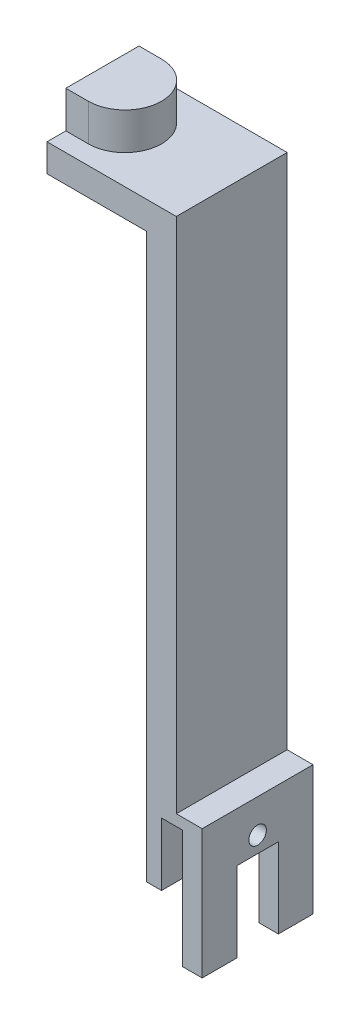
ISO-10303-21;
HEADER;
FILE_DESCRIPTION(('STEP AP214'),'2;1');
FILE_NAME('part.step','',(''),(''),'','','');
FILE_SCHEMA(('AUTOMOTIVE_DESIGN { 1 0 10303 214 1 1 1 1 }'));
ENDSEC;
DATA;
#1=APPLICATION_CONTEXT('core data for automotive mechanical design processes');
#2=APPLICATION_PROTOCOL_DEFINITION('international standard','automotive_design',2000,#1);
#3=PRODUCT_CONTEXT('',#1,'mechanical');
#4=PRODUCT('Part','Part','',(#3));
#5=PRODUCT_RELATED_PRODUCT_CATEGORY('part','',(#4));
#6=PRODUCT_DEFINITION_FORMATION('','',#4);
#7=PRODUCT_DEFINITION_CONTEXT('part definition',#1,'design');
#8=PRODUCT_DEFINITION('design','',#6,#7);
#9=PRODUCT_DEFINITION_SHAPE('','',#8);
#10=(LENGTH_UNIT() NAMED_UNIT(*) SI_UNIT(.MILLI.,.METRE.));
#11=(NAMED_UNIT(*) PLANE_ANGLE_UNIT() SI_UNIT($,.RADIAN.));
#12=(NAMED_UNIT(*) SI_UNIT($,.STERADIAN.) SOLID_ANGLE_UNIT());
#13=UNCERTAINTY_MEASURE_WITH_UNIT(LENGTH_MEASURE(1.E-05),#10,'distance_accuracy_value','');
#14=(GEOMETRIC_REPRESENTATION_CONTEXT(3) GLOBAL_UNCERTAINTY_ASSIGNED_CONTEXT((#13)) GLOBAL_UNIT_ASSIGNED_CONTEXT((#10,
#11,#12)) REPRESENTATION_CONTEXT('',''));
#15=CARTESIAN_POINT('',(0.,0.,0.));
#16=DIRECTION('',(0.,0.,1.));
#17=DIRECTION('',(1.,0.,0.));
#18=AXIS2_PLACEMENT_3D('',#15,#16,#17);
#19=CARTESIAN_POINT('',(2.2,-15.,15.));
#20=DIRECTION('',(0.,-1.,0.));
#21=DIRECTION('',(0.,0.,-1.));
#22=AXIS2_PLACEMENT_3D('',#19,#20,#21);
#23=PLANE('',#22);
#24=DIRECTION('',(1.,0.,0.));
#25=VECTOR('',#24,1.);
#26=CARTESIAN_POINT('',(-34.501,-15.,5.625));
#27=LINE('',#26,#25);
#28=CARTESIAN_POINT('',(2.2,-15.,5.625));
#29=VERTEX_POINT('',#28);
#30=CARTESIAN_POINT('',(7.5,-15.,5.625));
#31=VERTEX_POINT('',#30);
#32=EDGE_CURVE('E181',#29,#31,#27,.T.);
#33=ORIENTED_EDGE('',*,*,#32,.T.);
#34=DIRECTION('',(0.,0.,-1.));
#35=VECTOR('',#34,1.);
#36=CARTESIAN_POINT('',(7.5,-15.,15.));
#37=LINE('',#36,#35);
#38=CARTESIAN_POINT('',(7.5,-15.,15.));
#39=VERTEX_POINT('',#38);
#40=EDGE_CURVE('E210',#39,#31,#37,.T.);
#41=ORIENTED_EDGE('',*,*,#40,.F.);
#42=DIRECTION('',(1.,0.,0.));
#43=VECTOR('',#42,1.);
#44=CARTESIAN_POINT('',(2.2,-15.,15.));
#45=LINE('',#44,#43);
#46=CARTESIAN_POINT('',(2.2,-15.,15.));
#47=VERTEX_POINT('',#46);
#48=EDGE_CURVE('E205',#47,#39,#45,.T.);
#49=ORIENTED_EDGE('',*,*,#48,.F.);
#50=DIRECTION('',(0.,0.,-1.));
#51=VECTOR('',#50,1.);
#52=CARTESIAN_POINT('',(2.2,-15.,15.));
#53=LINE('',#52,#51);
#54=EDGE_CURVE('E199',#47,#29,#53,.T.);
#55=ORIENTED_EDGE('',*,*,#54,.T.);
#56=EDGE_LOOP('',(#33,#41,#49,#55));
#57=FACE_BOUND('',#56,.T.);
#58=ADVANCED_FACE('F43',(#57),#23,.T.);
#59=CARTESIAN_POINT('',(7.5,20.,15.));
#60=DIRECTION('',(0.,0.,-1.));
#61=DIRECTION('',(-1.,0.,0.));
#62=AXIS2_PLACEMENT_3D('',#59,#60,#61);
#63=PLANE('',#62);
#64=DIRECTION('',(1.,0.,0.));
#65=VECTOR('',#64,1.);
#66=CARTESIAN_POINT('',(0.,160.,15.));
#67=LINE('',#66,#65);
#68=CARTESIAN_POINT('',(-34.5,160.,15.));
#69=VERTEX_POINT('',#68);
#70=CARTESIAN_POINT('',(0.500000000000002,160.,15.));
#71=VERTEX_POINT('',#70);
#72=EDGE_CURVE('E226',#69,#71,#67,.T.);
#73=ORIENTED_EDGE('',*,*,#72,.F.);
#74=DIRECTION('',(0.,1.,0.));
#75=VECTOR('',#74,1.);
#76=CARTESIAN_POINT('',(-34.5,170.,15.));
#77=LINE('',#76,#75);
#78=CARTESIAN_POINT('',(-34.5,152.5,15.));
#79=VERTEX_POINT('',#78);
#80=EDGE_CURVE('E256',#79,#69,#77,.T.);
#81=ORIENTED_EDGE('',*,*,#80,.F.);
#82=DIRECTION('',(1.,0.,0.));
#83=VECTOR('',#82,1.);
#84=CARTESIAN_POINT('',(-34.5,152.5,15.));
#85=LINE('',#84,#83);
#86=CARTESIAN_POINT('',(-7.5,152.5,15.));
#87=VERTEX_POINT('',#86);
#88=EDGE_CURVE('E262',#79,#87,#85,.T.);
#89=ORIENTED_EDGE('',*,*,#88,.T.);
#90=DIRECTION('',(0.,-1.,0.));
#91=VECTOR('',#90,1.);
#92=CARTESIAN_POINT('',(-7.5,20.,15.));
#93=LINE('',#92,#91);
#94=CARTESIAN_POINT('',(-7.5,0.,15.));
#95=VERTEX_POINT('',#94);
#96=EDGE_CURVE('E11',#87,#95,#93,.T.);
#97=ORIENTED_EDGE('',*,*,#96,.T.);
#98=DIRECTION('',(1.,0.,0.));
#99=VECTOR('',#98,1.);
#100=CARTESIAN_POINT('',(7.5,0.,15.));
#101=LINE('',#100,#99);
#102=CARTESIAN_POINT('',(-3.5,0.,15.));
#103=VERTEX_POINT('',#102);
#104=EDGE_CURVE('E321',#95,#103,#101,.T.);
#105=ORIENTED_EDGE('',*,*,#104,.T.);
#106=DIRECTION('',(0.,-1.,0.));
#107=VECTOR('',#106,1.);
#108=CARTESIAN_POINT('',(-3.5,0.,15.));
#109=LINE('',#108,#107);
#110=CARTESIAN_POINT('',(-3.5,17.,15.));
#111=VERTEX_POINT('',#110);
#112=EDGE_CURVE('E286',#111,#103,#109,.T.);
#113=ORIENTED_EDGE('',*,*,#112,.F.);
#114=DIRECTION('',(-1.,0.,0.));
#115=VECTOR('',#114,1.);
#116=CARTESIAN_POINT('',(-3.5,17.,15.));
#117=LINE('',#116,#115);
#118=CARTESIAN_POINT('',(2.2,17.,15.));
#119=VERTEX_POINT('',#118);
#120=EDGE_CURVE('E291',#119,#111,#117,.T.);
#121=ORIENTED_EDGE('',*,*,#120,.F.);
#122=DIRECTION('',(0.,1.,0.));
#123=VECTOR('',#122,1.);
#124=CARTESIAN_POINT('',(2.2,0.,15.));
#125=LINE('',#124,#123);
#126=EDGE_CURVE('E299',#47,#119,#125,.T.);
#127=ORIENTED_EDGE('',*,*,#126,.F.);
#128=ORIENTED_EDGE('',*,*,#48,.T.);
#129=DIRECTION('',(0.,-1.,0.));
#130=VECTOR('',#129,1.);
#131=CARTESIAN_POINT('',(7.5,20.,15.));
#132=LINE('',#131,#130);
#133=CARTESIAN_POINT('',(7.5,20.,15.));
#134=VERTEX_POINT('',#133);
#135=EDGE_CURVE('E52',#134,#39,#132,.T.);
#136=ORIENTED_EDGE('',*,*,#135,.F.);
#137=DIRECTION('',(1.,0.,0.));
#138=VECTOR('',#137,1.);
#139=CARTESIAN_POINT('',(7.5,20.,15.));
#140=LINE('',#139,#138);
#141=CARTESIAN_POINT('',(0.5,20.,15.));
#142=VERTEX_POINT('',#141);
#143=EDGE_CURVE('E310',#142,#134,#140,.T.);
#144=ORIENTED_EDGE('',*,*,#143,.F.);
#145=DIRECTION('',(0.,-1.,0.));
#146=VECTOR('',#145,1.);
#147=CARTESIAN_POINT('',(0.500000000000002,170.,15.));
#148=LINE('',#147,#146);
#149=EDGE_CURVE('E284',#71,#142,#148,.T.);
#150=ORIENTED_EDGE('',*,*,#149,.F.);
#151=EDGE_LOOP('',(#73,#81,#89,#97,#105,#113,#121,#127,#128,#136,#144,#150));
#152=FACE_BOUND('',#151,.T.);
#153=ADVANCED_FACE('F338',(#152),#63,.F.);
#154=CARTESIAN_POINT('',(7.5,20.,-15.));
#155=DIRECTION('',(0.,0.,1.));
#156=DIRECTION('',(1.,0.,0.));
#157=AXIS2_PLACEMENT_3D('',#154,#155,#156);
#158=PLANE('',#157);
#159=DIRECTION('',(-1.,0.,0.));
#160=VECTOR('',#159,1.);
#161=CARTESIAN_POINT('',(0.,160.,-15.));
#162=LINE('',#161,#160);
#163=CARTESIAN_POINT('',(0.499999999999999,160.,-15.));
#164=VERTEX_POINT('',#163);
#165=CARTESIAN_POINT('',(-34.5,160.,-15.));
#166=VERTEX_POINT('',#165);
#167=EDGE_CURVE('E67',#164,#166,#162,.T.);
#168=ORIENTED_EDGE('',*,*,#167,.F.);
#169=DIRECTION('',(0.,-1.,0.));
#170=VECTOR('',#169,1.);
#171=CARTESIAN_POINT('',(0.499999999999999,170.,-15.));
#172=LINE('',#171,#170);
#173=CARTESIAN_POINT('',(0.499999999999999,20.,-15.));
#174=VERTEX_POINT('',#173);
#175=EDGE_CURVE('E282',#164,#174,#172,.T.);
#176=ORIENTED_EDGE('',*,*,#175,.T.);
#177=DIRECTION('',(-1.,0.,0.));
#178=VECTOR('',#177,1.);
#179=CARTESIAN_POINT('',(7.5,20.,-15.));
#180=LINE('',#179,#178);
#181=CARTESIAN_POINT('',(7.5,20.,-15.));
#182=VERTEX_POINT('',#181);
#183=EDGE_CURVE('E315',#182,#174,#180,.T.);
#184=ORIENTED_EDGE('',*,*,#183,.F.);
#185=DIRECTION('',(0.,-1.,0.));
#186=VECTOR('',#185,1.);
#187=CARTESIAN_POINT('',(7.5,20.,-15.));
#188=LINE('',#187,#186);
#189=CARTESIAN_POINT('',(7.5,-15.,-15.));
#190=VERTEX_POINT('',#189);
#191=EDGE_CURVE('E327',#182,#190,#188,.T.);
#192=ORIENTED_EDGE('',*,*,#191,.T.);
#193=DIRECTION('',(1.,0.,0.));
#194=VECTOR('',#193,1.);
#195=CARTESIAN_POINT('',(2.2,-15.,-15.));
#196=LINE('',#195,#194);
#197=CARTESIAN_POINT('',(2.2,-15.,-15.));
#198=VERTEX_POINT('',#197);
#199=EDGE_CURVE('E208',#198,#190,#196,.T.);
#200=ORIENTED_EDGE('',*,*,#199,.F.);
#201=DIRECTION('',(0.,1.,0.));
#202=VECTOR('',#201,1.);
#203=CARTESIAN_POINT('',(2.2,0.,-15.));
#204=LINE('',#203,#202);
#205=CARTESIAN_POINT('',(2.2,17.,-15.));
#206=VERTEX_POINT('',#205);
#207=EDGE_CURVE('E290',#198,#206,#204,.T.);
#208=ORIENTED_EDGE('',*,*,#207,.T.);
#209=DIRECTION('',(-1.,0.,0.));
#210=VECTOR('',#209,1.);
#211=CARTESIAN_POINT('',(-3.5,17.,-15.));
#212=LINE('',#211,#210);
#213=CARTESIAN_POINT('',(-3.5,17.,-15.));
#214=VERTEX_POINT('',#213);
#215=EDGE_CURVE('E294',#206,#214,#212,.T.);
#216=ORIENTED_EDGE('',*,*,#215,.T.);
#217=DIRECTION('',(0.,-1.,0.));
#218=VECTOR('',#217,1.);
#219=CARTESIAN_POINT('',(-3.5,0.,-15.));
#220=LINE('',#219,#218);
#221=CARTESIAN_POINT('',(-3.5,0.,-15.));
#222=VERTEX_POINT('',#221);
#223=EDGE_CURVE('E287',#214,#222,#220,.T.);
#224=ORIENTED_EDGE('',*,*,#223,.T.);
#225=DIRECTION('',(-1.,0.,0.));
#226=VECTOR('',#225,1.);
#227=CARTESIAN_POINT('',(7.5,0.,-15.));
#228=LINE('',#227,#226);
#229=CARTESIAN_POINT('',(-7.5,0.,-15.));
#230=VERTEX_POINT('',#229);
#231=EDGE_CURVE('E313',#222,#230,#228,.T.);
#232=ORIENTED_EDGE('',*,*,#231,.T.);
#233=DIRECTION('',(0.,-1.,0.));
#234=VECTOR('',#233,1.);
#235=CARTESIAN_POINT('',(-7.5,20.,-15.));
#236=LINE('',#235,#234);
#237=CARTESIAN_POINT('',(-7.5,152.5,-15.));
#238=VERTEX_POINT('',#237);
#239=EDGE_CURVE('E318',#238,#230,#236,.T.);
#240=ORIENTED_EDGE('',*,*,#239,.F.);
#241=DIRECTION('',(1.,0.,0.));
#242=VECTOR('',#241,1.);
#243=CARTESIAN_POINT('',(-34.5,152.5,-15.));
#244=LINE('',#243,#242);
#245=CARTESIAN_POINT('',(-34.5,152.5,-15.));
#246=VERTEX_POINT('',#245);
#247=EDGE_CURVE('E267',#246,#238,#244,.T.);
#248=ORIENTED_EDGE('',*,*,#247,.F.);
#249=DIRECTION('',(0.,-1.,0.));
#250=VECTOR('',#249,1.);
#251=CARTESIAN_POINT('',(-34.5,170.,-15.));
#252=LINE('',#251,#250);
#253=EDGE_CURVE('E252',#166,#246,#252,.T.);
#254=ORIENTED_EDGE('',*,*,#253,.F.);
#255=EDGE_LOOP('',(#168,#176,#184,#192,#200,#208,#216,#224,#232,#240,#248,#254));
#256=FACE_BOUND('',#255,.T.);
#257=ADVANCED_FACE('F349',(#256),#158,.F.);
#258=CARTESIAN_POINT('',(0.499999999999999,170.,-15.));
#259=DIRECTION('',(-1.,0.,0.));
#260=DIRECTION('',(0.,0.,1.));
#261=AXIS2_PLACEMENT_3D('',#258,#259,#260);
#262=PLANE('',#261);
#263=DIRECTION('',(0.,0.,-1.));
#264=VECTOR('',#263,1.);
#265=CARTESIAN_POINT('',(0.5,160.,0.));
#266=LINE('',#265,#264);
#267=EDGE_CURVE('E229',#71,#164,#266,.T.);
#268=ORIENTED_EDGE('',*,*,#267,.F.);
#269=ORIENTED_EDGE('',*,*,#149,.T.);
#270=DIRECTION('',(0.,0.,-1.));
#271=VECTOR('',#270,1.);
#272=CARTESIAN_POINT('',(0.499999999999999,20.,-15.));
#273=LINE('',#272,#271);
#274=EDGE_CURVE('E279',#142,#174,#273,.T.);
#275=ORIENTED_EDGE('',*,*,#274,.T.);
#276=ORIENTED_EDGE('',*,*,#175,.F.);
#277=EDGE_LOOP('',(#268,#269,#275,#276));
#278=FACE_BOUND('',#277,.T.);
#279=ADVANCED_FACE('F425',(#278),#262,.F.);
#280=CARTESIAN_POINT('',(0.,170.,0.));
#281=DIRECTION('',(0.,1.,0.));
#282=DIRECTION('',(0.,0.,1.));
#283=AXIS2_PLACEMENT_3D('',#280,#281,#282);
#284=PLANE('',#283);
#285=CARTESIAN_POINT('',(-28.4,170.,0.));
#286=DIRECTION('',(0.,1.,0.));
#287=DIRECTION('',(0.,0.,1.));
#288=AXIS2_PLACEMENT_3D('',#285,#286,#287);
#289=CIRCLE('',#288,9.9);
#290=CARTESIAN_POINT('',(-28.4,170.,9.9));
#291=VERTEX_POINT('',#290);
#292=CARTESIAN_POINT('',(-28.4,170.,-9.9));
#293=VERTEX_POINT('',#292);
#294=EDGE_CURVE('E216',#291,#293,#289,.T.);
#295=ORIENTED_EDGE('',*,*,#294,.T.);
#296=DIRECTION('',(-1.,0.,0.));
#297=VECTOR('',#296,1.);
#298=CARTESIAN_POINT('',(0.,170.,-9.9));
#299=LINE('',#298,#297);
#300=CARTESIAN_POINT('',(-34.5,170.,-9.9));
#301=VERTEX_POINT('',#300);
#302=EDGE_CURVE('E222',#293,#301,#299,.T.);
#303=ORIENTED_EDGE('',*,*,#302,.T.);
#304=DIRECTION('',(0.,0.,-1.));
#305=VECTOR('',#304,1.);
#306=CARTESIAN_POINT('',(-34.5,170.,-15.));
#307=LINE('',#306,#305);
#308=CARTESIAN_POINT('',(-34.5,170.,9.9));
#309=VERTEX_POINT('',#308);
#310=EDGE_CURVE('E259',#309,#301,#307,.T.);
#311=ORIENTED_EDGE('',*,*,#310,.F.);
#312=DIRECTION('',(1.,0.,0.));
#313=VECTOR('',#312,1.);
#314=CARTESIAN_POINT('',(0.,170.,9.90000000000001));
#315=LINE('',#314,#313);
#316=EDGE_CURVE('E237',#309,#291,#315,.T.);
#317=ORIENTED_EDGE('',*,*,#316,.T.);
#318=EDGE_LOOP('',(#295,#303,#311,#317));
#319=FACE_BOUND('',#318,.T.);
#320=ADVANCED_FACE('F413',(#319),#284,.T.);
#321=CARTESIAN_POINT('',(-34.5,0.,0.));
#322=DIRECTION('',(-1.,0.,0.));
#323=DIRECTION('',(0.,0.,1.));
#324=AXIS2_PLACEMENT_3D('',#321,#322,#323);
#325=PLANE('',#324);
#326=DIRECTION('',(0.,0.,1.));
#327=VECTOR('',#326,1.);
#328=CARTESIAN_POINT('',(-34.5,160.,0.));
#329=LINE('',#328,#327);
#330=CARTESIAN_POINT('',(-34.5,160.,9.9));
#331=VERTEX_POINT('',#330);
#332=EDGE_CURVE('E224',#331,#69,#329,.T.);
#333=ORIENTED_EDGE('',*,*,#332,.F.);
#334=DIRECTION('',(0.,1.,0.));
#335=VECTOR('',#334,1.);
#336=CARTESIAN_POINT('',(-34.5,160.,9.9));
#337=LINE('',#336,#335);
#338=EDGE_CURVE('E248',#331,#309,#337,.T.);
#339=ORIENTED_EDGE('',*,*,#338,.T.);
#340=ORIENTED_EDGE('',*,*,#310,.T.);
#341=DIRECTION('',(0.,1.,0.));
#342=VECTOR('',#341,1.);
#343=CARTESIAN_POINT('',(-34.5,160.,-9.9));
#344=LINE('',#343,#342);
#345=CARTESIAN_POINT('',(-34.5,160.,-9.9));
#346=VERTEX_POINT('',#345);
#347=EDGE_CURVE('E246',#346,#301,#344,.T.);
#348=ORIENTED_EDGE('',*,*,#347,.F.);
#349=EDGE_CURVE('E227',#166,#346,#329,.T.);
#350=ORIENTED_EDGE('',*,*,#349,.F.);
#351=ORIENTED_EDGE('',*,*,#253,.T.);
#352=DIRECTION('',(0.,0.,1.));
#353=VECTOR('',#352,1.);
#354=CARTESIAN_POINT('',(-34.5,152.5,-15.));
#355=LINE('',#354,#353);
#356=EDGE_CURVE('E254',#246,#79,#355,.T.);
#357=ORIENTED_EDGE('',*,*,#356,.T.);
#358=ORIENTED_EDGE('',*,*,#80,.T.);
#359=EDGE_LOOP('',(#333,#339,#340,#348,#350,#351,#357,#358));
#360=FACE_BOUND('',#359,.T.);
#361=ADVANCED_FACE('F410',(#360),#325,.T.);
#362=CARTESIAN_POINT('',(-7.5,20.,15.));
#363=DIRECTION('',(1.,0.,0.));
#364=DIRECTION('',(0.,0.,-1.));
#365=AXIS2_PLACEMENT_3D('',#362,#363,#364);
#366=PLANE('',#365);
#367=CARTESIAN_POINT('',(-7.5,11.,0.));
#368=DIRECTION('',(1.,0.,0.));
#369=DIRECTION('',(0.,0.,-1.));
#370=AXIS2_PLACEMENT_3D('',#367,#368,#369);
#371=CIRCLE('',#370,2.375);
#372=CARTESIAN_POINT('',(-7.5,11.,-2.375));
#373=VERTEX_POINT('',#372);
#374=EDGE_CURVE('E271',#373,#373,#371,.T.);
#375=ORIENTED_EDGE('',*,*,#374,.T.);
#376=EDGE_LOOP('',(#375));
#377=FACE_BOUND('',#376,.T.);
#378=DIRECTION('',(0.,0.,1.));
#379=VECTOR('',#378,1.);
#380=CARTESIAN_POINT('',(-7.5,152.5,-15.));
#381=LINE('',#380,#379);
#382=EDGE_CURVE('E245',#238,#87,#381,.T.);
#383=ORIENTED_EDGE('',*,*,#382,.F.);
#384=ORIENTED_EDGE('',*,*,#239,.T.);
#385=DIRECTION('',(0.,0.,1.));
#386=VECTOR('',#385,1.);
#387=CARTESIAN_POINT('',(-7.5,0.,15.));
#388=LINE('',#387,#386);
#389=EDGE_CURVE('E305',#230,#95,#388,.T.);
#390=ORIENTED_EDGE('',*,*,#389,.T.);
#391=ORIENTED_EDGE('',*,*,#96,.F.);
#392=EDGE_LOOP('',(#383,#384,#390,#391));
#393=FACE_BOUND('',#392,.T.);
#394=ADVANCED_FACE('F45',(#377,#393),#366,.F.);
#395=CARTESIAN_POINT('',(0.,0.,0.));
#396=DIRECTION('',(0.,1.,0.));
#397=DIRECTION('',(0.,0.,1.));
#398=AXIS2_PLACEMENT_3D('',#395,#396,#397);
#399=PLANE('',#398);
#400=ORIENTED_EDGE('',*,*,#231,.F.);
#401=DIRECTION('',(0.,0.,1.));
#402=VECTOR('',#401,1.);
#403=CARTESIAN_POINT('',(-3.5,0.,-15.));
#404=LINE('',#403,#402);
#405=EDGE_CURVE('E297',#222,#103,#404,.T.);
#406=ORIENTED_EDGE('',*,*,#405,.T.);
#407=ORIENTED_EDGE('',*,*,#104,.F.);
#408=ORIENTED_EDGE('',*,*,#389,.F.);
#409=EDGE_LOOP('',(#400,#406,#407,#408));
#410=FACE_BOUND('',#409,.T.);
#411=ADVANCED_FACE('F442',(#410),#399,.F.);
#412=CARTESIAN_POINT('',(7.5,20.,15.));
#413=DIRECTION('',(-1.,0.,0.));
#414=DIRECTION('',(0.,0.,1.));
#415=AXIS2_PLACEMENT_3D('',#412,#413,#414);
#416=PLANE('',#415);
#417=CARTESIAN_POINT('',(7.5,11.,0.));
#418=DIRECTION('',(1.,0.,0.));
#419=DIRECTION('',(0.,0.,-1.));
#420=AXIS2_PLACEMENT_3D('',#417,#418,#419);
#421=CIRCLE('',#420,2.375);
#422=CARTESIAN_POINT('',(7.5,11.,-2.375));
#423=VERTEX_POINT('',#422);
#424=EDGE_CURVE('E270',#423,#423,#421,.T.);
#425=ORIENTED_EDGE('',*,*,#424,.F.);
#426=EDGE_LOOP('',(#425));
#427=FACE_BOUND('',#426,.T.);
#428=ORIENTED_EDGE('',*,*,#40,.T.);
#429=DIRECTION('',(0.,-1.,0.));
#430=VECTOR('',#429,1.);
#431=CARTESIAN_POINT('',(7.5,-15.,5.625));
#432=LINE('',#431,#430);
#433=CARTESIAN_POINT('',(7.5,6.625,5.625));
#434=VERTEX_POINT('',#433);
#435=EDGE_CURVE('E187',#434,#31,#432,.T.);
#436=ORIENTED_EDGE('',*,*,#435,.F.);
#437=DIRECTION('',(0.,0.,1.));
#438=VECTOR('',#437,1.);
#439=CARTESIAN_POINT('',(7.5,6.625,5.625));
#440=LINE('',#439,#438);
#441=CARTESIAN_POINT('',(7.5,6.625,-5.625));
#442=VERTEX_POINT('',#441);
#443=EDGE_CURVE('E193',#442,#434,#440,.T.);
#444=ORIENTED_EDGE('',*,*,#443,.F.);
#445=DIRECTION('',(0.,1.,0.));
#446=VECTOR('',#445,1.);
#447=CARTESIAN_POINT('',(7.5,-15.,-5.625));
#448=LINE('',#447,#446);
#449=CARTESIAN_POINT('',(7.5,-15.,-5.625));
#450=VERTEX_POINT('',#449);
#451=EDGE_CURVE('E358',#450,#442,#448,.T.);
#452=ORIENTED_EDGE('',*,*,#451,.F.);
#453=EDGE_CURVE('E214',#450,#190,#37,.T.);
#454=ORIENTED_EDGE('',*,*,#453,.T.);
#455=ORIENTED_EDGE('',*,*,#191,.F.);
#456=DIRECTION('',(0.,0.,-1.));
#457=VECTOR('',#456,1.);
#458=CARTESIAN_POINT('',(7.5,20.,15.));
#459=LINE('',#458,#457);
#460=EDGE_CURVE('E312',#134,#182,#459,.T.);
#461=ORIENTED_EDGE('',*,*,#460,.F.);
#462=ORIENTED_EDGE('',*,*,#135,.T.);
#463=EDGE_LOOP('',(#428,#436,#444,#452,#454,#455,#461,#462));
#464=FACE_BOUND('',#463,.T.);
#465=ADVANCED_FACE('F333',(#427,#464),#416,.F.);
#466=CARTESIAN_POINT('',(0.,20.,0.));
#467=DIRECTION('',(0.,1.,0.));
#468=DIRECTION('',(0.,0.,1.));
#469=AXIS2_PLACEMENT_3D('',#466,#467,#468);
#470=PLANE('',#469);
#471=ORIENTED_EDGE('',*,*,#274,.F.);
#472=ORIENTED_EDGE('',*,*,#143,.T.);
#473=ORIENTED_EDGE('',*,*,#460,.T.);
#474=ORIENTED_EDGE('',*,*,#183,.T.);
#475=EDGE_LOOP('',(#471,#472,#473,#474));
#476=FACE_BOUND('',#475,.T.);
#477=ADVANCED_FACE('F437',(#476),#470,.T.);
#478=CARTESIAN_POINT('',(-3.5,0.,-15.));
#479=DIRECTION('',(-1.,0.,0.));
#480=DIRECTION('',(0.,0.,1.));
#481=AXIS2_PLACEMENT_3D('',#478,#479,#480);
#482=PLANE('',#481);
#483=CARTESIAN_POINT('',(-3.5,11.,0.));
#484=DIRECTION('',(-1.,0.,0.));
#485=DIRECTION('',(0.,0.,1.));
#486=AXIS2_PLACEMENT_3D('',#483,#484,#485);
#487=CIRCLE('',#486,2.375);
#488=CARTESIAN_POINT('',(-3.5,11.,2.375));
#489=VERTEX_POINT('',#488);
#490=EDGE_CURVE('E276',#489,#489,#487,.T.);
#491=ORIENTED_EDGE('',*,*,#490,.T.);
#492=EDGE_LOOP('',(#491));
#493=FACE_BOUND('',#492,.T.);
#494=ORIENTED_EDGE('',*,*,#112,.T.);
#495=ORIENTED_EDGE('',*,*,#405,.F.);
#496=ORIENTED_EDGE('',*,*,#223,.F.);
#497=DIRECTION('',(0.,0.,1.));
#498=VECTOR('',#497,1.);
#499=CARTESIAN_POINT('',(-3.5,17.,-15.));
#500=LINE('',#499,#498);
#501=EDGE_CURVE('E303',#214,#111,#500,.T.);
#502=ORIENTED_EDGE('',*,*,#501,.T.);
#503=EDGE_LOOP('',(#494,#495,#496,#502));
#504=FACE_BOUND('',#503,.T.);
#505=ADVANCED_FACE('F432',(#493,#504),#482,.F.);
#506=CARTESIAN_POINT('',(-3.5,17.,-15.));
#507=DIRECTION('',(0.,1.,0.));
#508=DIRECTION('',(0.,0.,1.));
#509=AXIS2_PLACEMENT_3D('',#506,#507,#508);
#510=PLANE('',#509);
#511=ORIENTED_EDGE('',*,*,#120,.T.);
#512=ORIENTED_EDGE('',*,*,#501,.F.);
#513=ORIENTED_EDGE('',*,*,#215,.F.);
#514=DIRECTION('',(0.,0.,1.));
#515=VECTOR('',#514,1.);
#516=CARTESIAN_POINT('',(2.2,17.,-15.));
#517=LINE('',#516,#515);
#518=EDGE_CURVE('E306',#206,#119,#517,.T.);
#519=ORIENTED_EDGE('',*,*,#518,.T.);
#520=EDGE_LOOP('',(#511,#512,#513,#519));
#521=FACE_BOUND('',#520,.T.);
#522=ADVANCED_FACE('F346',(#521),#510,.F.);
#523=CARTESIAN_POINT('',(2.2,0.,-15.));
#524=DIRECTION('',(1.,0.,0.));
#525=DIRECTION('',(0.,0.,-1.));
#526=AXIS2_PLACEMENT_3D('',#523,#524,#525);
#527=PLANE('',#526);
#528=CARTESIAN_POINT('',(2.2,11.,0.));
#529=DIRECTION('',(1.,0.,0.));
#530=DIRECTION('',(0.,0.,-1.));
#531=AXIS2_PLACEMENT_3D('',#528,#529,#530);
#532=CIRCLE('',#531,2.375);
#533=CARTESIAN_POINT('',(2.2,11.,-2.375));
#534=VERTEX_POINT('',#533);
#535=EDGE_CURVE('E47',#534,#534,#532,.T.);
#536=ORIENTED_EDGE('',*,*,#535,.T.);
#537=EDGE_LOOP('',(#536));
#538=FACE_BOUND('',#537,.T.);
#539=DIRECTION('',(0.,0.,-1.));
#540=VECTOR('',#539,1.);
#541=CARTESIAN_POINT('',(2.2,6.625,5.625));
#542=LINE('',#541,#540);
#543=CARTESIAN_POINT('',(2.2,6.625,5.625));
#544=VERTEX_POINT('',#543);
#545=CARTESIAN_POINT('',(2.2,6.625,-5.625));
#546=VERTEX_POINT('',#545);
#547=EDGE_CURVE('E201',#544,#546,#542,.T.);
#548=ORIENTED_EDGE('',*,*,#547,.F.);
#549=DIRECTION('',(0.,1.,0.));
#550=VECTOR('',#549,1.);
#551=CARTESIAN_POINT('',(2.2,-15.,5.625));
#552=LINE('',#551,#550);
#553=EDGE_CURVE('E184',#29,#544,#552,.T.);
#554=ORIENTED_EDGE('',*,*,#553,.F.);
#555=ORIENTED_EDGE('',*,*,#54,.F.);
#556=ORIENTED_EDGE('',*,*,#126,.T.);
#557=ORIENTED_EDGE('',*,*,#518,.F.);
#558=ORIENTED_EDGE('',*,*,#207,.F.);
#559=CARTESIAN_POINT('',(2.2,-15.,-5.625));
#560=VERTEX_POINT('',#559);
#561=EDGE_CURVE('E206',#560,#198,#53,.T.);
#562=ORIENTED_EDGE('',*,*,#561,.F.);
#563=DIRECTION('',(0.,-1.,0.));
#564=VECTOR('',#563,1.);
#565=CARTESIAN_POINT('',(2.2,-15.,-5.625));
#566=LINE('',#565,#564);
#567=EDGE_CURVE('E59',#546,#560,#566,.T.);
#568=ORIENTED_EDGE('',*,*,#567,.F.);
#569=EDGE_LOOP('',(#548,#554,#555,#556,#557,#558,#562,#568));
#570=FACE_BOUND('',#569,.T.);
#571=ADVANCED_FACE('F197',(#538,#570),#527,.F.);
#572=CARTESIAN_POINT('',(-7.5,11.,0.));
#573=DIRECTION('',(1.,0.,0.));
#574=DIRECTION('',(0.,0.,-1.));
#575=AXIS2_PLACEMENT_3D('',#572,#573,#574);
#576=CYLINDRICAL_SURFACE('',#575,2.375);
#577=ORIENTED_EDGE('',*,*,#424,.T.);
#578=EDGE_LOOP('',(#577));
#579=FACE_BOUND('',#578,.T.);
#580=ORIENTED_EDGE('',*,*,#535,.F.);
#581=EDGE_LOOP('',(#580));
#582=FACE_BOUND('',#581,.T.);
#583=ADVANCED_FACE('F421',(#579,#582),#576,.F.);
#584=ORIENTED_EDGE('',*,*,#374,.F.);
#585=EDGE_LOOP('',(#584));
#586=FACE_BOUND('',#585,.T.);
#587=ORIENTED_EDGE('',*,*,#490,.F.);
#588=EDGE_LOOP('',(#587));
#589=FACE_BOUND('',#588,.T.);
#590=ADVANCED_FACE('F417',(#586,#589),#576,.F.);
#591=CARTESIAN_POINT('',(-34.5,152.5,-15.));
#592=DIRECTION('',(0.,1.,0.));
#593=DIRECTION('',(0.,0.,1.));
#594=AXIS2_PLACEMENT_3D('',#591,#592,#593);
#595=PLANE('',#594);
#596=ORIENTED_EDGE('',*,*,#382,.T.);
#597=ORIENTED_EDGE('',*,*,#88,.F.);
#598=ORIENTED_EDGE('',*,*,#356,.F.);
#599=ORIENTED_EDGE('',*,*,#247,.T.);
#600=EDGE_LOOP('',(#596,#597,#598,#599));
#601=FACE_BOUND('',#600,.T.);
#602=ADVANCED_FACE('F408',(#601),#595,.F.);
#603=CARTESIAN_POINT('',(-28.4,160.,0.));
#604=DIRECTION('',(0.,1.,0.));
#605=DIRECTION('',(0.,0.,1.));
#606=AXIS2_PLACEMENT_3D('',#603,#604,#605);
#607=CYLINDRICAL_SURFACE('',#606,9.9);
#608=ORIENTED_EDGE('',*,*,#294,.F.);
#609=DIRECTION('',(0.,1.,0.));
#610=VECTOR('',#609,1.);
#611=CARTESIAN_POINT('',(-28.4,160.,9.9));
#612=LINE('',#611,#610);
#613=CARTESIAN_POINT('',(-28.4,160.,9.9));
#614=VERTEX_POINT('',#613);
#615=EDGE_CURVE('E234',#614,#291,#612,.T.);
#616=ORIENTED_EDGE('',*,*,#615,.F.);
#617=CARTESIAN_POINT('',(-28.4,160.,0.));
#618=DIRECTION('',(0.,1.,0.));
#619=DIRECTION('',(0.,0.,1.));
#620=AXIS2_PLACEMENT_3D('',#617,#618,#619);
#621=CIRCLE('',#620,9.9);
#622=CARTESIAN_POINT('',(-28.4,160.,-9.9));
#623=VERTEX_POINT('',#622);
#624=EDGE_CURVE('E218',#614,#623,#621,.T.);
#625=ORIENTED_EDGE('',*,*,#624,.T.);
#626=DIRECTION('',(0.,1.,0.));
#627=VECTOR('',#626,1.);
#628=CARTESIAN_POINT('',(-28.4,160.,-9.9));
#629=LINE('',#628,#627);
#630=EDGE_CURVE('E242',#623,#293,#629,.T.);
#631=ORIENTED_EDGE('',*,*,#630,.T.);
#632=EDGE_LOOP('',(#608,#616,#625,#631));
#633=FACE_BOUND('',#632,.T.);
#634=ADVANCED_FACE('F403',(#633),#607,.T.);
#635=CARTESIAN_POINT('',(0.,160.,-9.9));
#636=DIRECTION('',(0.,0.,-1.));
#637=DIRECTION('',(-1.,0.,0.));
#638=AXIS2_PLACEMENT_3D('',#635,#636,#637);
#639=PLANE('',#638);
#640=ORIENTED_EDGE('',*,*,#302,.F.);
#641=ORIENTED_EDGE('',*,*,#630,.F.);
#642=DIRECTION('',(-1.,0.,0.));
#643=VECTOR('',#642,1.);
#644=CARTESIAN_POINT('',(0.,160.,-9.9));
#645=LINE('',#644,#643);
#646=EDGE_CURVE('E232',#623,#346,#645,.T.);
#647=ORIENTED_EDGE('',*,*,#646,.T.);
#648=ORIENTED_EDGE('',*,*,#347,.T.);
#649=EDGE_LOOP('',(#640,#641,#647,#648));
#650=FACE_BOUND('',#649,.T.);
#651=ADVANCED_FACE('F397',(#650),#639,.T.);
#652=CARTESIAN_POINT('',(0.,160.,9.90000000000001));
#653=DIRECTION('',(0.,0.,1.));
#654=DIRECTION('',(1.,0.,0.));
#655=AXIS2_PLACEMENT_3D('',#652,#653,#654);
#656=PLANE('',#655);
#657=ORIENTED_EDGE('',*,*,#316,.F.);
#658=ORIENTED_EDGE('',*,*,#338,.F.);
#659=DIRECTION('',(1.,0.,0.));
#660=VECTOR('',#659,1.);
#661=CARTESIAN_POINT('',(0.,160.,9.90000000000001));
#662=LINE('',#661,#660);
#663=EDGE_CURVE('E221',#331,#614,#662,.T.);
#664=ORIENTED_EDGE('',*,*,#663,.T.);
#665=ORIENTED_EDGE('',*,*,#615,.T.);
#666=EDGE_LOOP('',(#657,#658,#664,#665));
#667=FACE_BOUND('',#666,.T.);
#668=ADVANCED_FACE('F393',(#667),#656,.T.);
#669=CARTESIAN_POINT('',(0.,160.,0.));
#670=DIRECTION('',(0.,1.,0.));
#671=DIRECTION('',(0.,0.,1.));
#672=AXIS2_PLACEMENT_3D('',#669,#670,#671);
#673=PLANE('',#672);
#674=ORIENTED_EDGE('',*,*,#624,.F.);
#675=ORIENTED_EDGE('',*,*,#663,.F.);
#676=ORIENTED_EDGE('',*,*,#332,.T.);
#677=ORIENTED_EDGE('',*,*,#72,.T.);
#678=ORIENTED_EDGE('',*,*,#267,.T.);
#679=ORIENTED_EDGE('',*,*,#167,.T.);
#680=ORIENTED_EDGE('',*,*,#349,.T.);
#681=ORIENTED_EDGE('',*,*,#646,.F.);
#682=EDGE_LOOP('',(#674,#675,#676,#677,#678,#679,#680,#681));
#683=FACE_BOUND('',#682,.T.);
#684=ADVANCED_FACE('F388',(#683),#673,.T.);
#685=DIRECTION('',(1.,0.,0.));
#686=VECTOR('',#685,1.);
#687=CARTESIAN_POINT('',(-34.501,-15.,-5.625));
#688=LINE('',#687,#686);
#689=EDGE_CURVE('E192',#560,#450,#688,.T.);
#690=ORIENTED_EDGE('',*,*,#689,.F.);
#691=ORIENTED_EDGE('',*,*,#561,.T.);
#692=ORIENTED_EDGE('',*,*,#199,.T.);
#693=ORIENTED_EDGE('',*,*,#453,.F.);
#694=EDGE_LOOP('',(#690,#691,#692,#693));
#695=FACE_BOUND('',#694,.T.);
#696=ADVANCED_FACE('F353',(#695),#23,.T.);
#697=CARTESIAN_POINT('',(-34.501,-15.,5.625));
#698=DIRECTION('',(0.,0.,1.));
#699=DIRECTION('',(1.,0.,0.));
#700=AXIS2_PLACEMENT_3D('',#697,#698,#699);
#701=PLANE('',#700);
#702=ORIENTED_EDGE('',*,*,#553,.T.);
#703=DIRECTION('',(1.,0.,0.));
#704=VECTOR('',#703,1.);
#705=CARTESIAN_POINT('',(-34.501,6.625,5.625));
#706=LINE('',#705,#704);
#707=EDGE_CURVE('E363',#544,#434,#706,.T.);
#708=ORIENTED_EDGE('',*,*,#707,.T.);
#709=ORIENTED_EDGE('',*,*,#435,.T.);
#710=ORIENTED_EDGE('',*,*,#32,.F.);
#711=EDGE_LOOP('',(#702,#708,#709,#710));
#712=FACE_BOUND('',#711,.T.);
#713=ADVANCED_FACE('F183',(#712),#701,.F.);
#714=CARTESIAN_POINT('',(-34.501,6.625,5.625));
#715=DIRECTION('',(0.,1.,0.));
#716=DIRECTION('',(0.,0.,1.));
#717=AXIS2_PLACEMENT_3D('',#714,#715,#716);
#718=PLANE('',#717);
#719=ORIENTED_EDGE('',*,*,#547,.T.);
#720=DIRECTION('',(1.,0.,0.));
#721=VECTOR('',#720,1.);
#722=CARTESIAN_POINT('',(-34.501,6.625,-5.625));
#723=LINE('',#722,#721);
#724=EDGE_CURVE('E365',#546,#442,#723,.T.);
#725=ORIENTED_EDGE('',*,*,#724,.T.);
#726=ORIENTED_EDGE('',*,*,#443,.T.);
#727=ORIENTED_EDGE('',*,*,#707,.F.);
#728=EDGE_LOOP('',(#719,#725,#726,#727));
#729=FACE_BOUND('',#728,.T.);
#730=ADVANCED_FACE('F370',(#729),#718,.F.);
#731=CARTESIAN_POINT('',(-34.501,-15.,-5.625));
#732=DIRECTION('',(0.,0.,-1.));
#733=DIRECTION('',(-1.,0.,0.));
#734=AXIS2_PLACEMENT_3D('',#731,#732,#733);
#735=PLANE('',#734);
#736=ORIENTED_EDGE('',*,*,#567,.T.);
#737=ORIENTED_EDGE('',*,*,#689,.T.);
#738=ORIENTED_EDGE('',*,*,#451,.T.);
#739=ORIENTED_EDGE('',*,*,#724,.F.);
#740=EDGE_LOOP('',(#736,#737,#738,#739));
#741=FACE_BOUND('',#740,.T.);
#742=ADVANCED_FACE('F367',(#741),#735,.F.);
#743=CLOSED_SHELL('',(#58,#153,#257,#279,#320,#361,#394,#411,#465,#477,#505,#522,#571,#583,#590,
#602,#634,#651,#668,#684,#696,#713,#730,#742));
#744=MANIFOLD_SOLID_BREP('B2',#743);
#745=ADVANCED_BREP_SHAPE_REPRESENTATION('',(#18,#744),#14);
#746=SHAPE_DEFINITION_REPRESENTATION(#9,#745);
ENDSEC;
END-ISO-10303-21;
